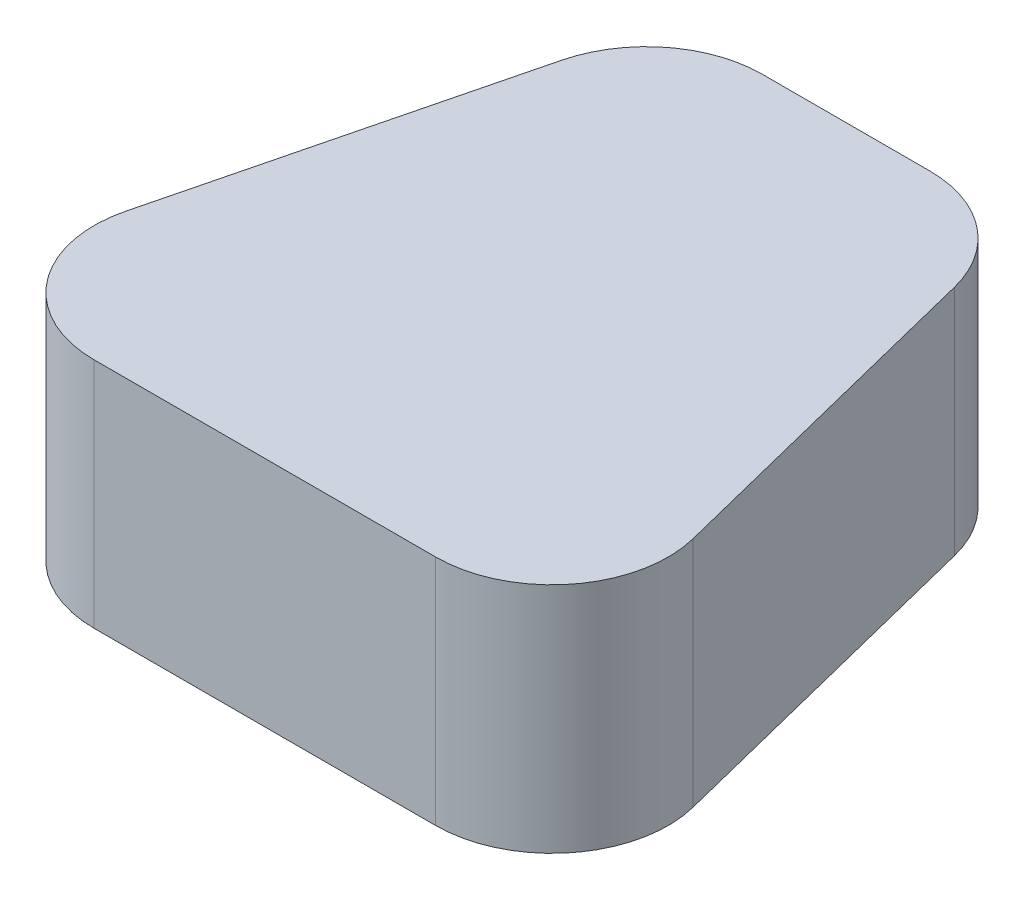
ISO-10303-21;
HEADER;
FILE_DESCRIPTION(('STEP AP214'),'2;1');
FILE_NAME('part.step','',(''),(''),'','','');
FILE_SCHEMA(('AUTOMOTIVE_DESIGN { 1 0 10303 214 1 1 1 1 }'));
ENDSEC;
DATA;
#1=APPLICATION_CONTEXT('core data for automotive mechanical design processes');
#2=APPLICATION_PROTOCOL_DEFINITION('international standard','automotive_design',2000,#1);
#3=PRODUCT_CONTEXT('',#1,'mechanical');
#4=PRODUCT('Part','Part','',(#3));
#5=PRODUCT_RELATED_PRODUCT_CATEGORY('part','',(#4));
#6=PRODUCT_DEFINITION_FORMATION('','',#4);
#7=PRODUCT_DEFINITION_CONTEXT('part definition',#1,'design');
#8=PRODUCT_DEFINITION('design','',#6,#7);
#9=PRODUCT_DEFINITION_SHAPE('','',#8);
#10=(LENGTH_UNIT() NAMED_UNIT(*) SI_UNIT(.MILLI.,.METRE.));
#11=(NAMED_UNIT(*) PLANE_ANGLE_UNIT() SI_UNIT($,.RADIAN.));
#12=(NAMED_UNIT(*) SI_UNIT($,.STERADIAN.) SOLID_ANGLE_UNIT());
#13=UNCERTAINTY_MEASURE_WITH_UNIT(LENGTH_MEASURE(1.E-05),#10,'distance_accuracy_value','');
#14=(GEOMETRIC_REPRESENTATION_CONTEXT(3) GLOBAL_UNCERTAINTY_ASSIGNED_CONTEXT((#13)) GLOBAL_UNIT_ASSIGNED_CONTEXT((#10,
#11,#12)) REPRESENTATION_CONTEXT('',''));
#15=CARTESIAN_POINT('',(0.,0.,0.));
#16=DIRECTION('',(0.,0.,1.));
#17=DIRECTION('',(1.,0.,0.));
#18=AXIS2_PLACEMENT_3D('',#15,#16,#17);
#19=CARTESIAN_POINT('',(0.,1.,0.));
#20=DIRECTION('',(0.,-1.,0.));
#21=DIRECTION('',(0.,0.,-1.));
#22=AXIS2_PLACEMENT_3D('',#19,#20,#21);
#23=PLANE('',#22);
#24=CARTESIAN_POINT('',(-6.84160068989698,0.999999999999994,3.95000000000001));
#25=DIRECTION('',(0.,1.,0.));
#26=DIRECTION('',(0.,0.,1.));
#27=AXIS2_PLACEMENT_3D('',#24,#25,#26);
#28=CIRCLE('',#27,5.);
#29=CARTESIAN_POINT('',(-6.84160068989698,0.999999999999994,8.95000000000001));
#30=VERTEX_POINT('',#29);
#31=EDGE_CURVE('E182',#30,#30,#28,.T.);
#32=ORIENTED_EDGE('',*,*,#31,.T.);
#33=EDGE_LOOP('',(#32));
#34=FACE_BOUND('',#33,.T.);
#35=DIRECTION('',(-0.242535625036333,0.,0.970142500145332));
#36=VECTOR('',#35,1.);
#37=CARTESIAN_POINT('',(-27.4999999999999,0.999999999999994,25.));
#38=LINE('',#37,#36);
#39=CARTESIAN_POINT('',(-16.8936609374091,0.999999999999997,-17.4253562503633));
#40=VERTEX_POINT('',#39);
#41=CARTESIAN_POINT('',(-24.3936609374091,0.999999999999997,12.5746437496367));
#42=VERTEX_POINT('',#41);
#43=EDGE_CURVE('E117',#40,#42,#38,.T.);
#44=ORIENTED_EDGE('',*,*,#43,.F.);
#45=CARTESIAN_POINT('',(-7.1922359359558,1.,-15.));
#46=DIRECTION('',(0.,-1.,0.));
#47=DIRECTION('',(0.,0.,-1.));
#48=AXIS2_PLACEMENT_3D('',#45,#46,#47);
#49=CIRCLE('',#48,10.);
#50=CARTESIAN_POINT('',(-7.19223593595586,1.,-25.));
#51=VERTEX_POINT('',#50);
#52=EDGE_CURVE('E100',#40,#51,#49,.T.);
#53=ORIENTED_EDGE('',*,*,#52,.T.);
#54=DIRECTION('',(-1.,0.,0.));
#55=VECTOR('',#54,1.);
#56=CARTESIAN_POINT('',(-15.,1.,-25.));
#57=LINE('',#56,#55);
#58=CARTESIAN_POINT('',(7.19223593595592,1.,-25.));
#59=VERTEX_POINT('',#58);
#60=EDGE_CURVE('E140',#59,#51,#57,.T.);
#61=ORIENTED_EDGE('',*,*,#60,.F.);
#62=CARTESIAN_POINT('',(7.19223593595586,1.,-15.));
#63=DIRECTION('',(0.,-1.,0.));
#64=DIRECTION('',(0.,0.,-1.));
#65=AXIS2_PLACEMENT_3D('',#62,#63,#64);
#66=CIRCLE('',#65,10.);
#67=CARTESIAN_POINT('',(16.8936609374092,1.,-17.4253562503633));
#68=VERTEX_POINT('',#67);
#69=EDGE_CURVE('E111',#59,#68,#66,.T.);
#70=ORIENTED_EDGE('',*,*,#69,.T.);
#71=DIRECTION('',(-0.242535625036333,0.,-0.970142500145332));
#72=VECTOR('',#71,1.);
#73=CARTESIAN_POINT('',(15.,1.,-25.));
#74=LINE('',#73,#72);
#75=CARTESIAN_POINT('',(24.3936609374092,1.,12.5746437496366));
#76=VERTEX_POINT('',#75);
#77=EDGE_CURVE('E130',#76,#68,#74,.T.);
#78=ORIENTED_EDGE('',*,*,#77,.F.);
#79=CARTESIAN_POINT('',(14.6922359359559,1.,15.));
#80=DIRECTION('',(0.,-1.,0.));
#81=DIRECTION('',(0.,0.,-1.));
#82=AXIS2_PLACEMENT_3D('',#79,#80,#81);
#83=CIRCLE('',#82,10.);
#84=CARTESIAN_POINT('',(14.692235935956,0.999999999999994,25.));
#85=VERTEX_POINT('',#84);
#86=EDGE_CURVE('E144',#76,#85,#83,.T.);
#87=ORIENTED_EDGE('',*,*,#86,.T.);
#88=DIRECTION('',(1.,0.,0.));
#89=VECTOR('',#88,1.);
#90=CARTESIAN_POINT('',(27.5,1.,25.));
#91=LINE('',#90,#89);
#92=CARTESIAN_POINT('',(-14.6922359359558,1.,25.));
#93=VERTEX_POINT('',#92);
#94=EDGE_CURVE('E126',#93,#85,#91,.T.);
#95=ORIENTED_EDGE('',*,*,#94,.F.);
#96=CARTESIAN_POINT('',(-14.6922359359559,0.999999999999994,15.));
#97=DIRECTION('',(0.,-1.,0.));
#98=DIRECTION('',(0.,0.,-1.));
#99=AXIS2_PLACEMENT_3D('',#96,#97,#98);
#100=CIRCLE('',#99,10.);
#101=EDGE_CURVE('E121',#93,#42,#100,.T.);
#102=ORIENTED_EDGE('',*,*,#101,.T.);
#103=EDGE_LOOP('',(#44,#53,#61,#70,#78,#87,#95,#102));
#104=FACE_BOUND('',#103,.T.);
#105=CARTESIAN_POINT('',(6.84160068989709,1.,3.95000000000006));
#106=DIRECTION('',(0.,1.,0.));
#107=DIRECTION('',(0.,0.,1.));
#108=AXIS2_PLACEMENT_3D('',#105,#106,#107);
#109=CIRCLE('',#108,5.);
#110=CARTESIAN_POINT('',(6.84160068989709,1.,8.95000000000006));
#111=VERTEX_POINT('',#110);
#112=EDGE_CURVE('E127',#111,#111,#109,.T.);
#113=ORIENTED_EDGE('',*,*,#112,.T.);
#114=EDGE_LOOP('',(#113));
#115=FACE_BOUND('',#114,.T.);
#116=CARTESIAN_POINT('',(0.,1.,-10.3));
#117=DIRECTION('',(0.,1.,0.));
#118=DIRECTION('',(0.,0.,1.));
#119=AXIS2_PLACEMENT_3D('',#116,#117,#118);
#120=CIRCLE('',#119,5.);
#121=CARTESIAN_POINT('',(0.,1.,-5.29999999999998));
#122=VERTEX_POINT('',#121);
#123=EDGE_CURVE('E188',#122,#122,#120,.T.);
#124=ORIENTED_EDGE('',*,*,#123,.T.);
#125=EDGE_LOOP('',(#124));
#126=FACE_BOUND('',#125,.T.);
#127=ADVANCED_FACE('F34',(#34,#104,#115,#126),#23,.T.);
#128=CARTESIAN_POINT('',(-27.4999999999999,21.,25.));
#129=DIRECTION('',(0.970142500145332,0.,0.242535625036333));
#130=DIRECTION('',(0.242535625036333,0.,-0.970142500145332));
#131=AXIS2_PLACEMENT_3D('',#128,#129,#130);
#132=PLANE('',#131);
#133=DIRECTION('',(-0.242535625036333,0.,0.970142500145332));
#134=VECTOR('',#133,1.);
#135=CARTESIAN_POINT('',(-27.4999999999999,21.,25.));
#136=LINE('',#135,#134);
#137=CARTESIAN_POINT('',(-16.8936609374091,21.,-17.4253562503633));
#138=VERTEX_POINT('',#137);
#139=CARTESIAN_POINT('',(-24.3936609374091,21.,12.5746437496367));
#140=VERTEX_POINT('',#139);
#141=EDGE_CURVE('E120',#138,#140,#136,.T.);
#142=ORIENTED_EDGE('',*,*,#141,.F.);
#143=DIRECTION('',(0.,-1.,0.));
#144=VECTOR('',#143,1.);
#145=CARTESIAN_POINT('',(-16.8936609374091,21.,-17.4253562503633));
#146=LINE('',#145,#144);
#147=EDGE_CURVE('E104',#138,#40,#146,.T.);
#148=ORIENTED_EDGE('',*,*,#147,.T.);
#149=ORIENTED_EDGE('',*,*,#43,.T.);
#150=DIRECTION('',(0.,-1.,0.));
#151=VECTOR('',#150,1.);
#152=CARTESIAN_POINT('',(-24.3936609374091,21.,12.5746437496367));
#153=LINE('',#152,#151);
#154=EDGE_CURVE('E122',#42,#140,#153,.F.);
#155=ORIENTED_EDGE('',*,*,#154,.T.);
#156=EDGE_LOOP('',(#142,#148,#149,#155));
#157=FACE_BOUND('',#156,.T.);
#158=ADVANCED_FACE('F116',(#157),#132,.F.);
#159=CARTESIAN_POINT('',(27.5,21.,25.));
#160=DIRECTION('',(0.,0.,-1.));
#161=DIRECTION('',(-1.,0.,0.));
#162=AXIS2_PLACEMENT_3D('',#159,#160,#161);
#163=PLANE('',#162);
#164=ORIENTED_EDGE('',*,*,#94,.T.);
#165=DIRECTION('',(0.,-1.,0.));
#166=VECTOR('',#165,1.);
#167=CARTESIAN_POINT('',(14.692235935956,21.,25.));
#168=LINE('',#167,#166);
#169=CARTESIAN_POINT('',(14.692235935956,21.,25.));
#170=VERTEX_POINT('',#169);
#171=EDGE_CURVE('E11',#85,#170,#168,.F.);
#172=ORIENTED_EDGE('',*,*,#171,.T.);
#173=DIRECTION('',(1.,0.,0.));
#174=VECTOR('',#173,1.);
#175=CARTESIAN_POINT('',(27.5,21.,25.));
#176=LINE('',#175,#174);
#177=CARTESIAN_POINT('',(-14.6922359359558,21.,25.));
#178=VERTEX_POINT('',#177);
#179=EDGE_CURVE('E166',#178,#170,#176,.T.);
#180=ORIENTED_EDGE('',*,*,#179,.F.);
#181=DIRECTION('',(0.,-1.,0.));
#182=VECTOR('',#181,1.);
#183=CARTESIAN_POINT('',(-14.6922359359558,21.,25.));
#184=LINE('',#183,#182);
#185=EDGE_CURVE('E42',#178,#93,#184,.T.);
#186=ORIENTED_EDGE('',*,*,#185,.T.);
#187=EDGE_LOOP('',(#164,#172,#180,#186));
#188=FACE_BOUND('',#187,.T.);
#189=ADVANCED_FACE('F164',(#188),#163,.F.);
#190=CARTESIAN_POINT('',(15.,21.,-25.));
#191=DIRECTION('',(-0.970142500145331,0.,0.242535625036333));
#192=DIRECTION('',(0.242535625036333,0.,0.970142500145331));
#193=AXIS2_PLACEMENT_3D('',#190,#191,#192);
#194=PLANE('',#193);
#195=ORIENTED_EDGE('',*,*,#77,.T.);
#196=DIRECTION('',(0.,-1.,0.));
#197=VECTOR('',#196,1.);
#198=CARTESIAN_POINT('',(16.8936609374092,21.,-17.4253562503633));
#199=LINE('',#198,#197);
#200=CARTESIAN_POINT('',(16.8936609374092,21.,-17.4253562503633));
#201=VERTEX_POINT('',#200);
#202=EDGE_CURVE('E49',#68,#201,#199,.F.);
#203=ORIENTED_EDGE('',*,*,#202,.T.);
#204=DIRECTION('',(-0.242535625036333,0.,-0.970142500145332));
#205=VECTOR('',#204,1.);
#206=CARTESIAN_POINT('',(15.,21.,-25.));
#207=LINE('',#206,#205);
#208=CARTESIAN_POINT('',(24.3936609374092,21.,12.5746437496367));
#209=VERTEX_POINT('',#208);
#210=EDGE_CURVE('E174',#209,#201,#207,.T.);
#211=ORIENTED_EDGE('',*,*,#210,.F.);
#212=DIRECTION('',(0.,-1.,0.));
#213=VECTOR('',#212,1.);
#214=CARTESIAN_POINT('',(24.3936609374092,21.,12.5746437496367));
#215=LINE('',#214,#213);
#216=EDGE_CURVE('E157',#209,#76,#215,.T.);
#217=ORIENTED_EDGE('',*,*,#216,.T.);
#218=EDGE_LOOP('',(#195,#203,#211,#217));
#219=FACE_BOUND('',#218,.T.);
#220=ADVANCED_FACE('F173',(#219),#194,.F.);
#221=CARTESIAN_POINT('',(-15.,21.,-25.));
#222=DIRECTION('',(0.,0.,1.));
#223=DIRECTION('',(1.,0.,0.));
#224=AXIS2_PLACEMENT_3D('',#221,#222,#223);
#225=PLANE('',#224);
#226=ORIENTED_EDGE('',*,*,#60,.T.);
#227=DIRECTION('',(0.,-1.,0.));
#228=VECTOR('',#227,1.);
#229=CARTESIAN_POINT('',(-7.19223593595586,21.,-25.));
#230=LINE('',#229,#228);
#231=CARTESIAN_POINT('',(-7.19223593595586,21.,-25.));
#232=VERTEX_POINT('',#231);
#233=EDGE_CURVE('E105',#51,#232,#230,.F.);
#234=ORIENTED_EDGE('',*,*,#233,.T.);
#235=DIRECTION('',(-1.,0.,0.));
#236=VECTOR('',#235,1.);
#237=CARTESIAN_POINT('',(-15.,21.,-25.));
#238=LINE('',#237,#236);
#239=CARTESIAN_POINT('',(7.19223593595592,21.,-25.));
#240=VERTEX_POINT('',#239);
#241=EDGE_CURVE('E136',#240,#232,#238,.T.);
#242=ORIENTED_EDGE('',*,*,#241,.F.);
#243=DIRECTION('',(0.,-1.,0.));
#244=VECTOR('',#243,1.);
#245=CARTESIAN_POINT('',(7.19223593595592,21.,-25.));
#246=LINE('',#245,#244);
#247=EDGE_CURVE('E110',#240,#59,#246,.T.);
#248=ORIENTED_EDGE('',*,*,#247,.T.);
#249=EDGE_LOOP('',(#226,#234,#242,#248));
#250=FACE_BOUND('',#249,.T.);
#251=ADVANCED_FACE('F217',(#250),#225,.F.);
#252=CARTESIAN_POINT('',(0.,21.,0.));
#253=DIRECTION('',(0.,-1.,0.));
#254=DIRECTION('',(0.,0.,-1.));
#255=AXIS2_PLACEMENT_3D('',#252,#253,#254);
#256=PLANE('',#255);
#257=ORIENTED_EDGE('',*,*,#241,.T.);
#258=CARTESIAN_POINT('',(-7.1922359359558,21.,-15.));
#259=DIRECTION('',(0.,-1.,0.));
#260=DIRECTION('',(0.,0.,-1.));
#261=AXIS2_PLACEMENT_3D('',#258,#259,#260);
#262=CIRCLE('',#261,10.);
#263=EDGE_CURVE('E155',#232,#138,#262,.F.);
#264=ORIENTED_EDGE('',*,*,#263,.T.);
#265=ORIENTED_EDGE('',*,*,#141,.T.);
#266=CARTESIAN_POINT('',(-14.6922359359559,21.,15.));
#267=DIRECTION('',(0.,-1.,0.));
#268=DIRECTION('',(0.,0.,-1.));
#269=AXIS2_PLACEMENT_3D('',#266,#267,#268);
#270=CIRCLE('',#269,10.);
#271=EDGE_CURVE('E150',#140,#178,#270,.F.);
#272=ORIENTED_EDGE('',*,*,#271,.T.);
#273=ORIENTED_EDGE('',*,*,#179,.T.);
#274=CARTESIAN_POINT('',(14.6922359359559,21.,15.));
#275=DIRECTION('',(0.,-1.,0.));
#276=DIRECTION('',(0.,0.,-1.));
#277=AXIS2_PLACEMENT_3D('',#274,#275,#276);
#278=CIRCLE('',#277,10.);
#279=EDGE_CURVE('E56',#170,#209,#278,.F.);
#280=ORIENTED_EDGE('',*,*,#279,.T.);
#281=ORIENTED_EDGE('',*,*,#210,.T.);
#282=CARTESIAN_POINT('',(7.19223593595586,21.,-15.));
#283=DIRECTION('',(0.,-1.,0.));
#284=DIRECTION('',(0.,0.,-1.));
#285=AXIS2_PLACEMENT_3D('',#282,#283,#284);
#286=CIRCLE('',#285,10.);
#287=EDGE_CURVE('E153',#201,#240,#286,.F.);
#288=ORIENTED_EDGE('',*,*,#287,.T.);
#289=EDGE_LOOP('',(#257,#264,#265,#272,#273,#280,#281,#288));
#290=FACE_BOUND('',#289,.T.);
#291=ADVANCED_FACE('F215',(#290),#256,.F.);
#292=CARTESIAN_POINT('',(-7.1922359359558,21.,-15.));
#293=DIRECTION('',(0.,-1.,0.));
#294=DIRECTION('',(0.,0.,-1.));
#295=AXIS2_PLACEMENT_3D('',#292,#293,#294);
#296=CYLINDRICAL_SURFACE('',#295,10.);
#297=ORIENTED_EDGE('',*,*,#263,.F.);
#298=ORIENTED_EDGE('',*,*,#233,.F.);
#299=ORIENTED_EDGE('',*,*,#52,.F.);
#300=ORIENTED_EDGE('',*,*,#147,.F.);
#301=EDGE_LOOP('',(#297,#298,#299,#300));
#302=FACE_BOUND('',#301,.T.);
#303=ADVANCED_FACE('F103',(#302),#296,.T.);
#304=CARTESIAN_POINT('',(7.19223593595586,21.,-15.));
#305=DIRECTION('',(0.,-1.,0.));
#306=DIRECTION('',(0.,0.,-1.));
#307=AXIS2_PLACEMENT_3D('',#304,#305,#306);
#308=CYLINDRICAL_SURFACE('',#307,10.);
#309=ORIENTED_EDGE('',*,*,#287,.F.);
#310=ORIENTED_EDGE('',*,*,#202,.F.);
#311=ORIENTED_EDGE('',*,*,#69,.F.);
#312=ORIENTED_EDGE('',*,*,#247,.F.);
#313=EDGE_LOOP('',(#309,#310,#311,#312));
#314=FACE_BOUND('',#313,.T.);
#315=ADVANCED_FACE('F227',(#314),#308,.T.);
#316=CARTESIAN_POINT('',(14.6922359359559,21.,15.));
#317=DIRECTION('',(0.,-1.,0.));
#318=DIRECTION('',(0.,0.,-1.));
#319=AXIS2_PLACEMENT_3D('',#316,#317,#318);
#320=CYLINDRICAL_SURFACE('',#319,10.);
#321=ORIENTED_EDGE('',*,*,#279,.F.);
#322=ORIENTED_EDGE('',*,*,#171,.F.);
#323=ORIENTED_EDGE('',*,*,#86,.F.);
#324=ORIENTED_EDGE('',*,*,#216,.F.);
#325=EDGE_LOOP('',(#321,#322,#323,#324));
#326=FACE_BOUND('',#325,.T.);
#327=ADVANCED_FACE('F172',(#326),#320,.T.);
#328=CARTESIAN_POINT('',(-14.6922359359559,21.,15.));
#329=DIRECTION('',(0.,-1.,0.));
#330=DIRECTION('',(0.,0.,-1.));
#331=AXIS2_PLACEMENT_3D('',#328,#329,#330);
#332=CYLINDRICAL_SURFACE('',#331,10.);
#333=ORIENTED_EDGE('',*,*,#271,.F.);
#334=ORIENTED_EDGE('',*,*,#154,.F.);
#335=ORIENTED_EDGE('',*,*,#101,.F.);
#336=ORIENTED_EDGE('',*,*,#185,.F.);
#337=EDGE_LOOP('',(#333,#334,#335,#336));
#338=FACE_BOUND('',#337,.T.);
#339=ADVANCED_FACE('F36',(#338),#332,.T.);
#340=CARTESIAN_POINT('',(6.84160068989709,15.142135623731,3.95000000000006));
#341=DIRECTION('',(0.,-1.,0.));
#342=DIRECTION('',(0.,0.,-1.));
#343=AXIS2_PLACEMENT_3D('',#340,#341,#342);
#344=CYLINDRICAL_SURFACE('',#343,5.);
#345=CARTESIAN_POINT('',(6.84160068989709,0.,3.95000000000006));
#346=DIRECTION('',(0.,1.,0.));
#347=DIRECTION('',(0.,0.,1.));
#348=AXIS2_PLACEMENT_3D('',#345,#346,#347);
#349=CIRCLE('',#348,5.);
#350=CARTESIAN_POINT('',(6.84160068989709,0.,8.95000000000006));
#351=VERTEX_POINT('',#350);
#352=EDGE_CURVE('E133',#351,#351,#349,.T.);
#353=ORIENTED_EDGE('',*,*,#352,.T.);
#354=EDGE_LOOP('',(#353));
#355=FACE_BOUND('',#354,.T.);
#356=ORIENTED_EDGE('',*,*,#112,.F.);
#357=EDGE_LOOP('',(#356));
#358=FACE_BOUND('',#357,.T.);
#359=ADVANCED_FACE('F234',(#355,#358),#344,.T.);
#360=CARTESIAN_POINT('',(6.84160068989709,0.,3.95000000000006));
#361=DIRECTION('',(0.,1.,0.));
#362=DIRECTION('',(0.,0.,1.));
#363=AXIS2_PLACEMENT_3D('',#360,#361,#362);
#364=PLANE('',#363);
#365=ORIENTED_EDGE('',*,*,#352,.F.);
#366=EDGE_LOOP('',(#365));
#367=FACE_BOUND('',#366,.T.);
#368=ADVANCED_FACE('F238',(#367),#364,.F.);
#369=CARTESIAN_POINT('',(-6.84160068989698,15.1421356237309,3.95000000000001));
#370=DIRECTION('',(0.,-1.,0.));
#371=DIRECTION('',(0.,0.,-1.));
#372=AXIS2_PLACEMENT_3D('',#369,#370,#371);
#373=CYLINDRICAL_SURFACE('',#372,5.);
#374=CARTESIAN_POINT('',(-6.84160068989698,0.,3.95000000000001));
#375=DIRECTION('',(0.,1.,0.));
#376=DIRECTION('',(0.,0.,1.));
#377=AXIS2_PLACEMENT_3D('',#374,#375,#376);
#378=CIRCLE('',#377,5.);
#379=CARTESIAN_POINT('',(-6.84160068989698,0.,8.95000000000001));
#380=VERTEX_POINT('',#379);
#381=EDGE_CURVE('E185',#380,#380,#378,.T.);
#382=ORIENTED_EDGE('',*,*,#381,.T.);
#383=EDGE_LOOP('',(#382));
#384=FACE_BOUND('',#383,.T.);
#385=ORIENTED_EDGE('',*,*,#31,.F.);
#386=EDGE_LOOP('',(#385));
#387=FACE_BOUND('',#386,.T.);
#388=ADVANCED_FACE('F278',(#384,#387),#373,.T.);
#389=CARTESIAN_POINT('',(-6.84160068989698,0.,3.95000000000001));
#390=DIRECTION('',(0.,1.,0.));
#391=DIRECTION('',(0.,0.,1.));
#392=AXIS2_PLACEMENT_3D('',#389,#390,#391);
#393=PLANE('',#392);
#394=ORIENTED_EDGE('',*,*,#381,.F.);
#395=EDGE_LOOP('',(#394));
#396=FACE_BOUND('',#395,.T.);
#397=ADVANCED_FACE('F204',(#396),#393,.F.);
#398=CARTESIAN_POINT('',(0.,15.1421356237309,-10.3));
#399=DIRECTION('',(0.,-1.,0.));
#400=DIRECTION('',(0.,0.,-1.));
#401=AXIS2_PLACEMENT_3D('',#398,#399,#400);
#402=CYLINDRICAL_SURFACE('',#401,5.);
#403=CARTESIAN_POINT('',(0.,0.,-10.3));
#404=DIRECTION('',(0.,1.,0.));
#405=DIRECTION('',(0.,0.,1.));
#406=AXIS2_PLACEMENT_3D('',#403,#404,#405);
#407=CIRCLE('',#406,5.);
#408=CARTESIAN_POINT('',(0.,0.,-5.29999999999998));
#409=VERTEX_POINT('',#408);
#410=EDGE_CURVE('E191',#409,#409,#407,.T.);
#411=ORIENTED_EDGE('',*,*,#410,.T.);
#412=EDGE_LOOP('',(#411));
#413=FACE_BOUND('',#412,.T.);
#414=ORIENTED_EDGE('',*,*,#123,.F.);
#415=EDGE_LOOP('',(#414));
#416=FACE_BOUND('',#415,.T.);
#417=ADVANCED_FACE('F195',(#413,#416),#402,.T.);
#418=CARTESIAN_POINT('',(0.,0.,-10.3));
#419=DIRECTION('',(0.,1.,0.));
#420=DIRECTION('',(0.,0.,1.));
#421=AXIS2_PLACEMENT_3D('',#418,#419,#420);
#422=PLANE('',#421);
#423=ORIENTED_EDGE('',*,*,#410,.F.);
#424=EDGE_LOOP('',(#423));
#425=FACE_BOUND('',#424,.T.);
#426=ADVANCED_FACE('F198',(#425),#422,.F.);
#427=CLOSED_SHELL('',(#127,#158,#189,#220,#251,#291,#303,#315,#327,#339,#359,#368,#388,#397,
#417,#426));
#428=MANIFOLD_SOLID_BREP('B2',#427);
#429=ADVANCED_BREP_SHAPE_REPRESENTATION('',(#18,#428),#14);
#430=SHAPE_DEFINITION_REPRESENTATION(#9,#429);
ENDSEC;
END-ISO-10303-21;
